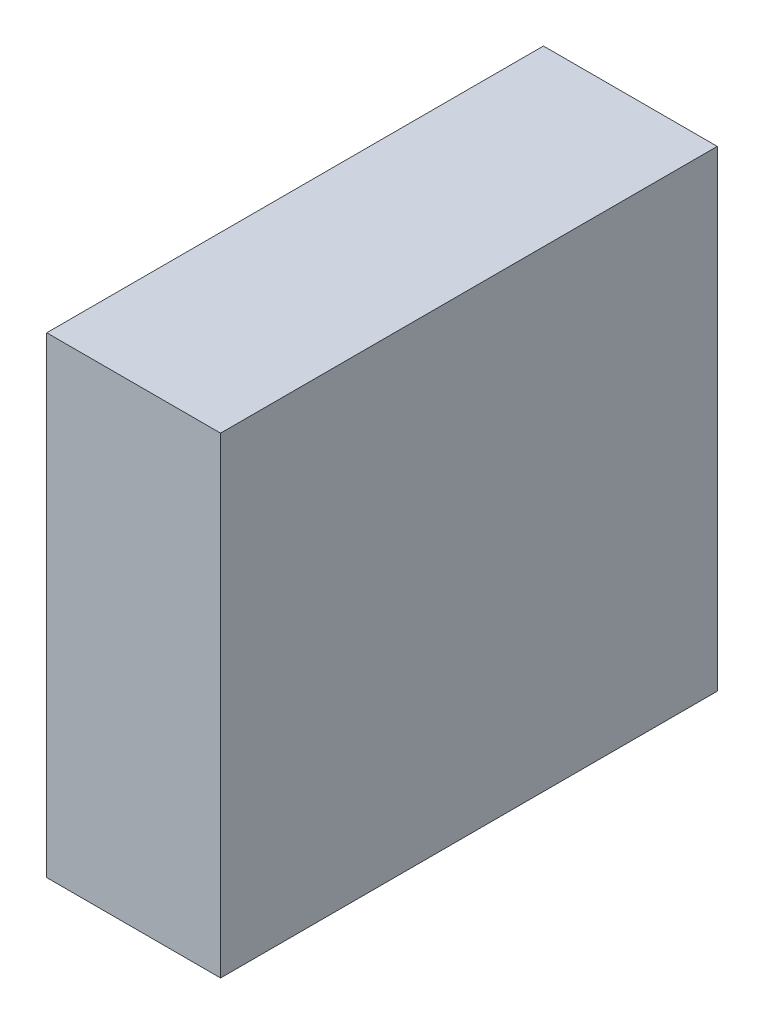
ISO-10303-21;
HEADER;
FILE_DESCRIPTION(('STEP AP214'),'2;1');
FILE_NAME('part.step','',(''),(''),'','','');
FILE_SCHEMA(('AUTOMOTIVE_DESIGN { 1 0 10303 214 1 1 1 1 }'));
ENDSEC;
DATA;
#1=APPLICATION_CONTEXT('core data for automotive mechanical design processes');
#2=APPLICATION_PROTOCOL_DEFINITION('international standard','automotive_design',2000,#1);
#3=PRODUCT_CONTEXT('',#1,'mechanical');
#4=PRODUCT('Part','Part','',(#3));
#5=PRODUCT_RELATED_PRODUCT_CATEGORY('part','',(#4));
#6=PRODUCT_DEFINITION_FORMATION('','',#4);
#7=PRODUCT_DEFINITION_CONTEXT('part definition',#1,'design');
#8=PRODUCT_DEFINITION('design','',#6,#7);
#9=PRODUCT_DEFINITION_SHAPE('','',#8);
#10=(LENGTH_UNIT() NAMED_UNIT(*) SI_UNIT(.MILLI.,.METRE.));
#11=(NAMED_UNIT(*) PLANE_ANGLE_UNIT() SI_UNIT($,.RADIAN.));
#12=(NAMED_UNIT(*) SI_UNIT($,.STERADIAN.) SOLID_ANGLE_UNIT());
#13=UNCERTAINTY_MEASURE_WITH_UNIT(LENGTH_MEASURE(1.E-05),#10,'distance_accuracy_value','');
#14=(GEOMETRIC_REPRESENTATION_CONTEXT(3) GLOBAL_UNCERTAINTY_ASSIGNED_CONTEXT((#13)) GLOBAL_UNIT_ASSIGNED_CONTEXT((#10,
#11,#12)) REPRESENTATION_CONTEXT('',''));
#15=CARTESIAN_POINT('',(0.,0.,0.));
#16=DIRECTION('',(0.,0.,1.));
#17=DIRECTION('',(1.,0.,0.));
#18=AXIS2_PLACEMENT_3D('',#15,#16,#17);
#19=CARTESIAN_POINT('',(0.17500092,-0.47499778,0.));
#20=DIRECTION('',(-1.,0.,0.));
#21=DIRECTION('',(0.,1.,0.));
#22=AXIS2_PLACEMENT_3D('',#19,#20,#21);
#23=PLANE('',#22);
#24=DIRECTION('',(0.,1.,0.));
#25=VECTOR('',#24,1.);
#26=CARTESIAN_POINT('',(0.17500092,-0.47499778,0.));
#27=LINE('',#26,#25);
#28=CARTESIAN_POINT('',(0.17500092,-0.47499778,0.));
#29=VERTEX_POINT('',#28);
#30=CARTESIAN_POINT('',(0.17500092,0.47500032,0.));
#31=VERTEX_POINT('',#30);
#32=EDGE_CURVE('E11',#29,#31,#27,.T.);
#33=ORIENTED_EDGE('',*,*,#32,.T.);
#34=DIRECTION('',(0.,0.,1.));
#35=VECTOR('',#34,1.);
#36=CARTESIAN_POINT('',(0.17500092,0.47500032,0.));
#37=LINE('',#36,#35);
#38=CARTESIAN_POINT('',(0.17500092,0.47500032,1.00000054));
#39=VERTEX_POINT('',#38);
#40=EDGE_CURVE('E23',#31,#39,#37,.T.);
#41=ORIENTED_EDGE('',*,*,#40,.T.);
#42=DIRECTION('',(0.,1.,0.));
#43=VECTOR('',#42,1.);
#44=CARTESIAN_POINT('',(0.17500092,-0.47499778,1.00000054));
#45=LINE('',#44,#43);
#46=CARTESIAN_POINT('',(0.17500092,-0.47499778,1.00000054));
#47=VERTEX_POINT('',#46);
#48=EDGE_CURVE('E86',#47,#39,#45,.T.);
#49=ORIENTED_EDGE('',*,*,#48,.F.);
#50=DIRECTION('',(0.,0.,1.));
#51=VECTOR('',#50,1.);
#52=CARTESIAN_POINT('',(0.17500092,-0.47499778,0.));
#53=LINE('',#52,#51);
#54=EDGE_CURVE('E35',#29,#47,#53,.T.);
#55=ORIENTED_EDGE('',*,*,#54,.F.);
#56=EDGE_LOOP('',(#33,#41,#49,#55));
#57=FACE_BOUND('',#56,.T.);
#58=ADVANCED_FACE('F16',(#57),#23,.F.);
#59=CARTESIAN_POINT('',(0.17500092,0.47500032,0.));
#60=DIRECTION('',(0.,-1.,0.));
#61=DIRECTION('',(-1.,0.,0.));
#62=AXIS2_PLACEMENT_3D('',#59,#60,#61);
#63=PLANE('',#62);
#64=DIRECTION('',(-1.,0.,0.));
#65=VECTOR('',#64,1.);
#66=CARTESIAN_POINT('',(0.17500092,0.47500032,0.));
#67=LINE('',#66,#65);
#68=CARTESIAN_POINT('',(-0.17500092,0.47500032,0.));
#69=VERTEX_POINT('',#68);
#70=EDGE_CURVE('E83',#31,#69,#67,.T.);
#71=ORIENTED_EDGE('',*,*,#70,.T.);
#72=DIRECTION('',(0.,0.,1.));
#73=VECTOR('',#72,1.);
#74=CARTESIAN_POINT('',(-0.17500092,0.47500032,0.));
#75=LINE('',#74,#73);
#76=CARTESIAN_POINT('',(-0.17500092,0.47500032,1.00000054));
#77=VERTEX_POINT('',#76);
#78=EDGE_CURVE('E81',#69,#77,#75,.T.);
#79=ORIENTED_EDGE('',*,*,#78,.T.);
#80=DIRECTION('',(-1.,0.,0.));
#81=VECTOR('',#80,1.);
#82=CARTESIAN_POINT('',(0.17500092,0.47500032,1.00000054));
#83=LINE('',#82,#81);
#84=EDGE_CURVE('E61',#39,#77,#83,.T.);
#85=ORIENTED_EDGE('',*,*,#84,.F.);
#86=ORIENTED_EDGE('',*,*,#40,.F.);
#87=EDGE_LOOP('',(#71,#79,#85,#86));
#88=FACE_BOUND('',#87,.T.);
#89=ADVANCED_FACE('F88',(#88),#63,.F.);
#90=CARTESIAN_POINT('',(-0.17500092,0.47500032,0.));
#91=DIRECTION('',(1.,0.,0.));
#92=DIRECTION('',(0.,-1.,0.));
#93=AXIS2_PLACEMENT_3D('',#90,#91,#92);
#94=PLANE('',#93);
#95=DIRECTION('',(0.,-1.,0.));
#96=VECTOR('',#95,1.);
#97=CARTESIAN_POINT('',(-0.17500092,0.47500032,0.));
#98=LINE('',#97,#96);
#99=CARTESIAN_POINT('',(-0.17500092,-0.47499778,0.));
#100=VERTEX_POINT('',#99);
#101=EDGE_CURVE('E70',#69,#100,#98,.T.);
#102=ORIENTED_EDGE('',*,*,#101,.T.);
#103=DIRECTION('',(0.,0.,1.));
#104=VECTOR('',#103,1.);
#105=CARTESIAN_POINT('',(-0.17500092,-0.47499778,0.));
#106=LINE('',#105,#104);
#107=CARTESIAN_POINT('',(-0.17500092,-0.47499778,1.00000054));
#108=VERTEX_POINT('',#107);
#109=EDGE_CURVE('E64',#100,#108,#106,.T.);
#110=ORIENTED_EDGE('',*,*,#109,.T.);
#111=DIRECTION('',(0.,-1.,0.));
#112=VECTOR('',#111,1.);
#113=CARTESIAN_POINT('',(-0.17500092,0.47500032,1.00000054));
#114=LINE('',#113,#112);
#115=EDGE_CURVE('E56',#77,#108,#114,.T.);
#116=ORIENTED_EDGE('',*,*,#115,.F.);
#117=ORIENTED_EDGE('',*,*,#78,.F.);
#118=EDGE_LOOP('',(#102,#110,#116,#117));
#119=FACE_BOUND('',#118,.T.);
#120=ADVANCED_FACE('F68',(#119),#94,.F.);
#121=CARTESIAN_POINT('',(-0.17500092,-0.47499778,0.));
#122=DIRECTION('',(0.,1.,0.));
#123=DIRECTION('',(1.,0.,0.));
#124=AXIS2_PLACEMENT_3D('',#121,#122,#123);
#125=PLANE('',#124);
#126=DIRECTION('',(1.,0.,0.));
#127=VECTOR('',#126,1.);
#128=CARTESIAN_POINT('',(-0.17500092,-0.47499778,0.));
#129=LINE('',#128,#127);
#130=EDGE_CURVE('E65',#100,#29,#129,.T.);
#131=ORIENTED_EDGE('',*,*,#130,.T.);
#132=ORIENTED_EDGE('',*,*,#54,.T.);
#133=DIRECTION('',(1.,0.,0.));
#134=VECTOR('',#133,1.);
#135=CARTESIAN_POINT('',(-0.17500092,-0.47499778,1.00000054));
#136=LINE('',#135,#134);
#137=EDGE_CURVE('E60',#108,#47,#136,.T.);
#138=ORIENTED_EDGE('',*,*,#137,.F.);
#139=ORIENTED_EDGE('',*,*,#109,.F.);
#140=EDGE_LOOP('',(#131,#132,#138,#139));
#141=FACE_BOUND('',#140,.T.);
#142=ADVANCED_FACE('F75',(#141),#125,.F.);
#143=CARTESIAN_POINT('',(0.17500092,-0.47499778,0.));
#144=DIRECTION('',(0.,0.,-1.));
#145=DIRECTION('',(-1.,0.,0.));
#146=AXIS2_PLACEMENT_3D('',#143,#144,#145);
#147=PLANE('',#146);
#148=ORIENTED_EDGE('',*,*,#130,.F.);
#149=ORIENTED_EDGE('',*,*,#101,.F.);
#150=ORIENTED_EDGE('',*,*,#70,.F.);
#151=ORIENTED_EDGE('',*,*,#32,.F.);
#152=EDGE_LOOP('',(#148,#149,#150,#151));
#153=FACE_BOUND('',#152,.T.);
#154=ADVANCED_FACE('F90',(#153),#147,.T.);
#155=CARTESIAN_POINT('',(0.17500092,-0.47499778,1.00000054));
#156=DIRECTION('',(0.,0.,-1.));
#157=DIRECTION('',(-1.,0.,0.));
#158=AXIS2_PLACEMENT_3D('',#155,#156,#157);
#159=PLANE('',#158);
#160=ORIENTED_EDGE('',*,*,#48,.T.);
#161=ORIENTED_EDGE('',*,*,#84,.T.);
#162=ORIENTED_EDGE('',*,*,#115,.T.);
#163=ORIENTED_EDGE('',*,*,#137,.T.);
#164=EDGE_LOOP('',(#160,#161,#162,#163));
#165=FACE_BOUND('',#164,.T.);
#166=ADVANCED_FACE('F58',(#165),#159,.F.);
#167=CLOSED_SHELL('',(#58,#89,#120,#142,#154,#166));
#168=MANIFOLD_SOLID_BREP('B1',#167);
#169=ADVANCED_BREP_SHAPE_REPRESENTATION('',(#18,#168),#14);
#170=SHAPE_DEFINITION_REPRESENTATION(#9,#169);
ENDSEC;
END-ISO-10303-21;
